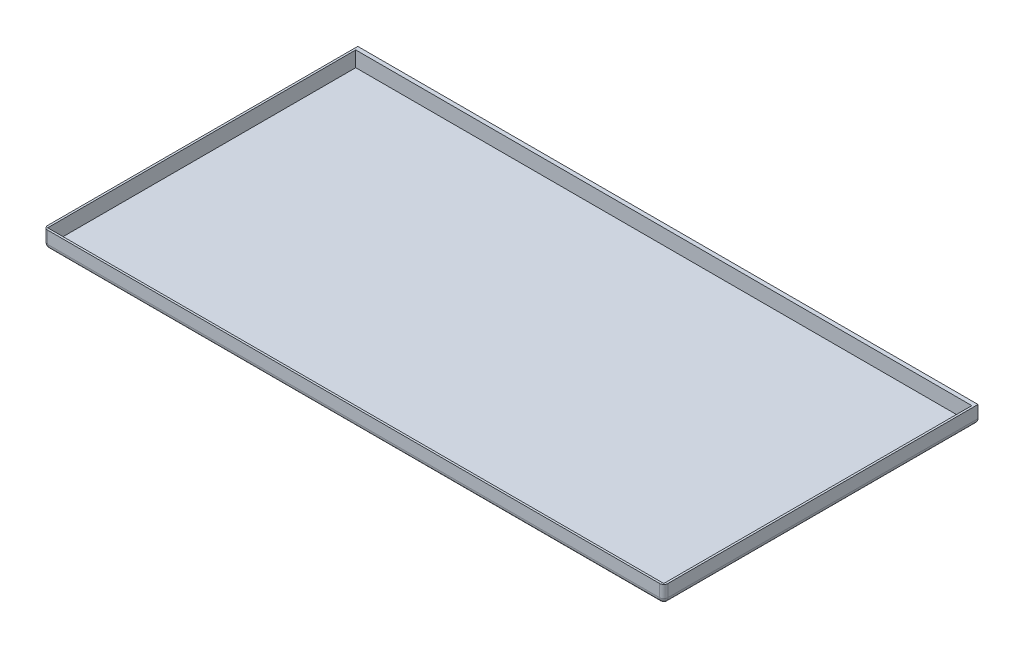
ISO-10303-21;
HEADER;
FILE_DESCRIPTION(('STEP AP214'),'2;1');
FILE_NAME('part.step','',(''),(''),'','','');
FILE_SCHEMA(('AUTOMOTIVE_DESIGN { 1 0 10303 214 1 1 1 1 }'));
ENDSEC;
DATA;
#1=APPLICATION_CONTEXT('core data for automotive mechanical design processes');
#2=APPLICATION_PROTOCOL_DEFINITION('international standard','automotive_design',2000,#1);
#3=PRODUCT_CONTEXT('',#1,'mechanical');
#4=PRODUCT('Part','Part','',(#3));
#5=PRODUCT_RELATED_PRODUCT_CATEGORY('part','',(#4));
#6=PRODUCT_DEFINITION_FORMATION('','',#4);
#7=PRODUCT_DEFINITION_CONTEXT('part definition',#1,'design');
#8=PRODUCT_DEFINITION('design','',#6,#7);
#9=PRODUCT_DEFINITION_SHAPE('','',#8);
#10=(LENGTH_UNIT() NAMED_UNIT(*) SI_UNIT(.MILLI.,.METRE.));
#11=(NAMED_UNIT(*) PLANE_ANGLE_UNIT() SI_UNIT($,.RADIAN.));
#12=(NAMED_UNIT(*) SI_UNIT($,.STERADIAN.) SOLID_ANGLE_UNIT());
#13=UNCERTAINTY_MEASURE_WITH_UNIT(LENGTH_MEASURE(1.E-05),#10,'distance_accuracy_value','');
#14=(GEOMETRIC_REPRESENTATION_CONTEXT(3) GLOBAL_UNCERTAINTY_ASSIGNED_CONTEXT((#13)) GLOBAL_UNIT_ASSIGNED_CONTEXT((#10,
#11,#12)) REPRESENTATION_CONTEXT('',''));
#15=CARTESIAN_POINT('',(0.,0.,0.));
#16=DIRECTION('',(0.,0.,1.));
#17=DIRECTION('',(1.,0.,0.));
#18=AXIS2_PLACEMENT_3D('',#15,#16,#17);
#19=CARTESIAN_POINT('',(-604.,4.,306.));
#20=DIRECTION('',(-1.,0.,0.));
#21=DIRECTION('',(0.,0.,1.));
#22=AXIS2_PLACEMENT_3D('',#19,#20,#21);
#23=PLANE('',#22);
#24=DIRECTION('',(0.,0.,-1.));
#25=VECTOR('',#24,1.);
#26=CARTESIAN_POINT('',(-604.,10.,306.));
#27=LINE('',#26,#25);
#28=CARTESIAN_POINT('',(-604.,10.,-306.));
#29=VERTEX_POINT('',#28);
#30=CARTESIAN_POINT('',(-604.,10.,298.));
#31=VERTEX_POINT('',#30);
#32=EDGE_CURVE('E235',#29,#31,#27,.F.);
#33=ORIENTED_EDGE('',*,*,#32,.T.);
#34=DIRECTION('',(0.,-1.,0.));
#35=VECTOR('',#34,1.);
#36=CARTESIAN_POINT('',(-604.,34.,298.));
#37=LINE('',#36,#35);
#38=CARTESIAN_POINT('',(-604.,34.,298.));
#39=VERTEX_POINT('',#38);
#40=EDGE_CURVE('E67',#31,#39,#37,.F.);
#41=ORIENTED_EDGE('',*,*,#40,.T.);
#42=DIRECTION('',(0.,0.,1.));
#43=VECTOR('',#42,1.);
#44=CARTESIAN_POINT('',(-604.,34.,306.));
#45=LINE('',#44,#43);
#46=CARTESIAN_POINT('',(-604.,34.,-306.));
#47=VERTEX_POINT('',#46);
#48=EDGE_CURVE('E197',#47,#39,#45,.T.);
#49=ORIENTED_EDGE('',*,*,#48,.F.);
#50=DIRECTION('',(0.,-1.,0.));
#51=VECTOR('',#50,1.);
#52=CARTESIAN_POINT('',(-604.,4.,-306.));
#53=LINE('',#52,#51);
#54=EDGE_CURVE('E203',#47,#29,#53,.T.);
#55=ORIENTED_EDGE('',*,*,#54,.T.);
#56=EDGE_LOOP('',(#33,#41,#49,#55));
#57=FACE_BOUND('',#56,.T.);
#58=ADVANCED_FACE('F41',(#57),#23,.T.);
#59=CARTESIAN_POINT('',(-604.,4.,306.));
#60=DIRECTION('',(0.,0.,-1.));
#61=DIRECTION('',(-1.,0.,0.));
#62=AXIS2_PLACEMENT_3D('',#59,#60,#61);
#63=PLANE('',#62);
#64=DIRECTION('',(1.,0.,0.));
#65=VECTOR('',#64,1.);
#66=CARTESIAN_POINT('',(-604.,34.,306.));
#67=LINE('',#66,#65);
#68=CARTESIAN_POINT('',(-596.,34.,306.));
#69=VERTEX_POINT('',#68);
#70=CARTESIAN_POINT('',(596.,34.,306.));
#71=VERTEX_POINT('',#70);
#72=EDGE_CURVE('E200',#69,#71,#67,.T.);
#73=ORIENTED_EDGE('',*,*,#72,.F.);
#74=DIRECTION('',(0.,-1.,0.));
#75=VECTOR('',#74,1.);
#76=CARTESIAN_POINT('',(-596.,10.,306.));
#77=LINE('',#76,#75);
#78=CARTESIAN_POINT('',(-596.,10.,306.));
#79=VERTEX_POINT('',#78);
#80=EDGE_CURVE('E263',#69,#79,#77,.T.);
#81=ORIENTED_EDGE('',*,*,#80,.T.);
#82=DIRECTION('',(1.,0.,0.));
#83=VECTOR('',#82,1.);
#84=CARTESIAN_POINT('',(604.,10.,306.));
#85=LINE('',#84,#83);
#86=CARTESIAN_POINT('',(596.,10.,306.));
#87=VERTEX_POINT('',#86);
#88=EDGE_CURVE('E208',#79,#87,#85,.T.);
#89=ORIENTED_EDGE('',*,*,#88,.T.);
#90=DIRECTION('',(0.,-1.,0.));
#91=VECTOR('',#90,1.);
#92=CARTESIAN_POINT('',(596.,4.,306.));
#93=LINE('',#92,#91);
#94=EDGE_CURVE('E260',#87,#71,#93,.F.);
#95=ORIENTED_EDGE('',*,*,#94,.T.);
#96=EDGE_LOOP('',(#73,#81,#89,#95));
#97=FACE_BOUND('',#96,.T.);
#98=ADVANCED_FACE('F312',(#97),#63,.F.);
#99=CARTESIAN_POINT('',(604.,4.,306.));
#100=DIRECTION('',(-1.,0.,0.));
#101=DIRECTION('',(0.,0.,1.));
#102=AXIS2_PLACEMENT_3D('',#99,#100,#101);
#103=PLANE('',#102);
#104=DIRECTION('',(0.,0.,-1.));
#105=VECTOR('',#104,1.);
#106=CARTESIAN_POINT('',(604.,34.,306.));
#107=LINE('',#106,#105);
#108=CARTESIAN_POINT('',(604.,34.,298.));
#109=VERTEX_POINT('',#108);
#110=CARTESIAN_POINT('',(604.,34.,-306.));
#111=VERTEX_POINT('',#110);
#112=EDGE_CURVE('E156',#109,#111,#107,.T.);
#113=ORIENTED_EDGE('',*,*,#112,.F.);
#114=DIRECTION('',(0.,-1.,0.));
#115=VECTOR('',#114,1.);
#116=CARTESIAN_POINT('',(604.,4.,298.));
#117=LINE('',#116,#115);
#118=CARTESIAN_POINT('',(604.,10.,298.));
#119=VERTEX_POINT('',#118);
#120=EDGE_CURVE('E11',#109,#119,#117,.T.);
#121=ORIENTED_EDGE('',*,*,#120,.T.);
#122=DIRECTION('',(0.,0.,-1.));
#123=VECTOR('',#122,1.);
#124=CARTESIAN_POINT('',(604.,10.,-306.));
#125=LINE('',#124,#123);
#126=CARTESIAN_POINT('',(604.,10.,-306.));
#127=VERTEX_POINT('',#126);
#128=EDGE_CURVE('E229',#119,#127,#125,.T.);
#129=ORIENTED_EDGE('',*,*,#128,.T.);
#130=DIRECTION('',(0.,-1.,0.));
#131=VECTOR('',#130,1.);
#132=CARTESIAN_POINT('',(604.,4.,-306.));
#133=LINE('',#132,#131);
#134=EDGE_CURVE('E204',#111,#127,#133,.T.);
#135=ORIENTED_EDGE('',*,*,#134,.F.);
#136=EDGE_LOOP('',(#113,#121,#129,#135));
#137=FACE_BOUND('',#136,.T.);
#138=ADVANCED_FACE('F316',(#137),#103,.F.);
#139=CARTESIAN_POINT('',(-604.,4.,-306.));
#140=DIRECTION('',(0.,0.,-1.));
#141=DIRECTION('',(-1.,0.,0.));
#142=AXIS2_PLACEMENT_3D('',#139,#140,#141);
#143=PLANE('',#142);
#144=ORIENTED_EDGE('',*,*,#134,.T.);
#145=DIRECTION('',(1.,0.,0.));
#146=VECTOR('',#145,1.);
#147=CARTESIAN_POINT('',(-604.,10.,-306.));
#148=LINE('',#147,#146);
#149=EDGE_CURVE('E232',#127,#29,#148,.F.);
#150=ORIENTED_EDGE('',*,*,#149,.T.);
#151=ORIENTED_EDGE('',*,*,#54,.F.);
#152=DIRECTION('',(-1.,0.,0.));
#153=VECTOR('',#152,1.);
#154=CARTESIAN_POINT('',(-604.,34.,-306.));
#155=LINE('',#154,#153);
#156=EDGE_CURVE('E193',#111,#47,#155,.T.);
#157=ORIENTED_EDGE('',*,*,#156,.F.);
#158=EDGE_LOOP('',(#144,#150,#151,#157));
#159=FACE_BOUND('',#158,.T.);
#160=ADVANCED_FACE('F320',(#159),#143,.T.);
#161=CARTESIAN_POINT('',(0.,0.,0.));
#162=DIRECTION('',(0.,-1.,0.));
#163=DIRECTION('',(0.,0.,-1.));
#164=AXIS2_PLACEMENT_3D('',#161,#162,#163);
#165=PLANE('',#164);
#166=DIRECTION('',(0.,0.,-1.));
#167=VECTOR('',#166,1.);
#168=CARTESIAN_POINT('',(594.,0.,306.));
#169=LINE('',#168,#167);
#170=CARTESIAN_POINT('',(594.,0.,-296.));
#171=VERTEX_POINT('',#170);
#172=CARTESIAN_POINT('',(594.,0.,296.));
#173=VERTEX_POINT('',#172);
#174=EDGE_CURVE('E221',#171,#173,#169,.F.);
#175=ORIENTED_EDGE('',*,*,#174,.T.);
#176=DIRECTION('',(1.,0.,0.));
#177=VECTOR('',#176,1.);
#178=CARTESIAN_POINT('',(-604.,0.,296.));
#179=LINE('',#178,#177);
#180=CARTESIAN_POINT('',(-594.,0.,296.));
#181=VERTEX_POINT('',#180);
#182=EDGE_CURVE('E225',#173,#181,#179,.F.);
#183=ORIENTED_EDGE('',*,*,#182,.T.);
#184=DIRECTION('',(0.,0.,-1.));
#185=VECTOR('',#184,1.);
#186=CARTESIAN_POINT('',(-594.,0.,0.));
#187=LINE('',#186,#185);
#188=CARTESIAN_POINT('',(-594.,0.,-296.));
#189=VERTEX_POINT('',#188);
#190=EDGE_CURVE('E215',#181,#189,#187,.T.);
#191=ORIENTED_EDGE('',*,*,#190,.T.);
#192=DIRECTION('',(1.,0.,0.));
#193=VECTOR('',#192,1.);
#194=CARTESIAN_POINT('',(0.,0.,-296.));
#195=LINE('',#194,#193);
#196=EDGE_CURVE('E218',#189,#171,#195,.T.);
#197=ORIENTED_EDGE('',*,*,#196,.T.);
#198=EDGE_LOOP('',(#175,#183,#191,#197));
#199=FACE_BOUND('',#198,.T.);
#200=ADVANCED_FACE('F323',(#199),#165,.T.);
#201=CARTESIAN_POINT('',(0.,34.,0.));
#202=DIRECTION('',(0.,-1.,0.));
#203=DIRECTION('',(0.,0.,-1.));
#204=AXIS2_PLACEMENT_3D('',#201,#202,#203);
#205=PLANE('',#204);
#206=ORIENTED_EDGE('',*,*,#48,.T.);
#207=CARTESIAN_POINT('',(-596.,34.,298.));
#208=DIRECTION('',(0.,-1.,0.));
#209=DIRECTION('',(0.,0.,-1.));
#210=AXIS2_PLACEMENT_3D('',#207,#208,#209);
#211=CIRCLE('',#210,8.);
#212=EDGE_CURVE('E51',#39,#69,#211,.F.);
#213=ORIENTED_EDGE('',*,*,#212,.T.);
#214=ORIENTED_EDGE('',*,*,#72,.T.);
#215=CARTESIAN_POINT('',(596.,34.,298.));
#216=DIRECTION('',(0.,-1.,0.));
#217=DIRECTION('',(0.,0.,-1.));
#218=AXIS2_PLACEMENT_3D('',#215,#216,#217);
#219=CIRCLE('',#218,8.);
#220=EDGE_CURVE('E59',#71,#109,#219,.F.);
#221=ORIENTED_EDGE('',*,*,#220,.T.);
#222=ORIENTED_EDGE('',*,*,#112,.T.);
#223=ORIENTED_EDGE('',*,*,#156,.T.);
#224=EDGE_LOOP('',(#206,#213,#214,#221,#222,#223));
#225=FACE_BOUND('',#224,.T.);
#226=DIRECTION('',(0.,0.,-1.));
#227=VECTOR('',#226,1.);
#228=CARTESIAN_POINT('',(600.,34.,-298.));
#229=LINE('',#228,#227);
#230=CARTESIAN_POINT('',(600.,34.,302.));
#231=VERTEX_POINT('',#230);
#232=CARTESIAN_POINT('',(600.,34.,-298.));
#233=VERTEX_POINT('',#232);
#234=EDGE_CURVE('E136',#231,#233,#229,.T.);
#235=ORIENTED_EDGE('',*,*,#234,.F.);
#236=DIRECTION('',(1.,0.,0.));
#237=VECTOR('',#236,1.);
#238=CARTESIAN_POINT('',(-600.,34.,302.));
#239=LINE('',#238,#237);
#240=CARTESIAN_POINT('',(-600.,34.,302.));
#241=VERTEX_POINT('',#240);
#242=EDGE_CURVE('E166',#241,#231,#239,.T.);
#243=ORIENTED_EDGE('',*,*,#242,.F.);
#244=DIRECTION('',(0.,0.,1.));
#245=VECTOR('',#244,1.);
#246=CARTESIAN_POINT('',(-600.,34.,-298.));
#247=LINE('',#246,#245);
#248=CARTESIAN_POINT('',(-600.,34.,-298.));
#249=VERTEX_POINT('',#248);
#250=EDGE_CURVE('E162',#249,#241,#247,.T.);
#251=ORIENTED_EDGE('',*,*,#250,.F.);
#252=DIRECTION('',(-1.,0.,0.));
#253=VECTOR('',#252,1.);
#254=CARTESIAN_POINT('',(-600.,34.,-298.));
#255=LINE('',#254,#253);
#256=EDGE_CURVE('E147',#233,#249,#255,.T.);
#257=ORIENTED_EDGE('',*,*,#256,.F.);
#258=EDGE_LOOP('',(#235,#243,#251,#257));
#259=FACE_BOUND('',#258,.T.);
#260=ADVANCED_FACE('F160',(#225,#259),#205,.F.);
#261=CARTESIAN_POINT('',(600.,34.,-298.));
#262=DIRECTION('',(-1.,0.,0.));
#263=DIRECTION('',(0.,0.,1.));
#264=AXIS2_PLACEMENT_3D('',#261,#262,#263);
#265=PLANE('',#264);
#266=DIRECTION('',(0.,0.,-1.));
#267=VECTOR('',#266,1.);
#268=CARTESIAN_POINT('',(600.,4.,-298.));
#269=LINE('',#268,#267);
#270=CARTESIAN_POINT('',(600.,4.,302.));
#271=VERTEX_POINT('',#270);
#272=CARTESIAN_POINT('',(600.,4.,-298.));
#273=VERTEX_POINT('',#272);
#274=EDGE_CURVE('E171',#271,#273,#269,.T.);
#275=ORIENTED_EDGE('',*,*,#274,.F.);
#276=DIRECTION('',(0.,-1.,0.));
#277=VECTOR('',#276,1.);
#278=CARTESIAN_POINT('',(600.,34.,302.));
#279=LINE('',#278,#277);
#280=EDGE_CURVE('E142',#231,#271,#279,.T.);
#281=ORIENTED_EDGE('',*,*,#280,.F.);
#282=ORIENTED_EDGE('',*,*,#234,.T.);
#283=DIRECTION('',(0.,-1.,0.));
#284=VECTOR('',#283,1.);
#285=CARTESIAN_POINT('',(600.,34.,-298.));
#286=LINE('',#285,#284);
#287=EDGE_CURVE('E140',#233,#273,#286,.T.);
#288=ORIENTED_EDGE('',*,*,#287,.T.);
#289=EDGE_LOOP('',(#275,#281,#282,#288));
#290=FACE_BOUND('',#289,.T.);
#291=ADVANCED_FACE('F139',(#290),#265,.T.);
#292=CARTESIAN_POINT('',(-600.,34.,-298.));
#293=DIRECTION('',(0.,0.,1.));
#294=DIRECTION('',(1.,0.,0.));
#295=AXIS2_PLACEMENT_3D('',#292,#293,#294);
#296=PLANE('',#295);
#297=DIRECTION('',(-1.,0.,0.));
#298=VECTOR('',#297,1.);
#299=CARTESIAN_POINT('',(-600.,4.,-298.));
#300=LINE('',#299,#298);
#301=CARTESIAN_POINT('',(-600.,4.,-298.));
#302=VERTEX_POINT('',#301);
#303=EDGE_CURVE('E154',#273,#302,#300,.T.);
#304=ORIENTED_EDGE('',*,*,#303,.F.);
#305=ORIENTED_EDGE('',*,*,#287,.F.);
#306=ORIENTED_EDGE('',*,*,#256,.T.);
#307=DIRECTION('',(0.,-1.,0.));
#308=VECTOR('',#307,1.);
#309=CARTESIAN_POINT('',(-600.,34.,-298.));
#310=LINE('',#309,#308);
#311=EDGE_CURVE('E157',#249,#302,#310,.T.);
#312=ORIENTED_EDGE('',*,*,#311,.T.);
#313=EDGE_LOOP('',(#304,#305,#306,#312));
#314=FACE_BOUND('',#313,.T.);
#315=ADVANCED_FACE('F151',(#314),#296,.T.);
#316=CARTESIAN_POINT('',(-600.,34.,-298.));
#317=DIRECTION('',(1.,0.,0.));
#318=DIRECTION('',(0.,0.,-1.));
#319=AXIS2_PLACEMENT_3D('',#316,#317,#318);
#320=PLANE('',#319);
#321=DIRECTION('',(0.,0.,1.));
#322=VECTOR('',#321,1.);
#323=CARTESIAN_POINT('',(-600.,4.,-298.));
#324=LINE('',#323,#322);
#325=CARTESIAN_POINT('',(-600.,4.,302.));
#326=VERTEX_POINT('',#325);
#327=EDGE_CURVE('E177',#302,#326,#324,.T.);
#328=ORIENTED_EDGE('',*,*,#327,.F.);
#329=ORIENTED_EDGE('',*,*,#311,.F.);
#330=ORIENTED_EDGE('',*,*,#250,.T.);
#331=DIRECTION('',(0.,-1.,0.));
#332=VECTOR('',#331,1.);
#333=CARTESIAN_POINT('',(-600.,34.,302.));
#334=LINE('',#333,#332);
#335=EDGE_CURVE('E186',#241,#326,#334,.T.);
#336=ORIENTED_EDGE('',*,*,#335,.T.);
#337=EDGE_LOOP('',(#328,#329,#330,#336));
#338=FACE_BOUND('',#337,.T.);
#339=ADVANCED_FACE('F342',(#338),#320,.T.);
#340=CARTESIAN_POINT('',(-600.,34.,302.));
#341=DIRECTION('',(0.,0.,-1.));
#342=DIRECTION('',(-1.,0.,0.));
#343=AXIS2_PLACEMENT_3D('',#340,#341,#342);
#344=PLANE('',#343);
#345=DIRECTION('',(1.,0.,0.));
#346=VECTOR('',#345,1.);
#347=CARTESIAN_POINT('',(-600.,4.,302.));
#348=LINE('',#347,#346);
#349=EDGE_CURVE('E148',#326,#271,#348,.T.);
#350=ORIENTED_EDGE('',*,*,#349,.F.);
#351=ORIENTED_EDGE('',*,*,#335,.F.);
#352=ORIENTED_EDGE('',*,*,#242,.T.);
#353=ORIENTED_EDGE('',*,*,#280,.T.);
#354=EDGE_LOOP('',(#350,#351,#352,#353));
#355=FACE_BOUND('',#354,.T.);
#356=ADVANCED_FACE('F334',(#355),#344,.T.);
#357=CARTESIAN_POINT('',(0.,4.,0.));
#358=DIRECTION('',(0.,-1.,0.));
#359=DIRECTION('',(0.,0.,-1.));
#360=AXIS2_PLACEMENT_3D('',#357,#358,#359);
#361=PLANE('',#360);
#362=ORIENTED_EDGE('',*,*,#349,.T.);
#363=ORIENTED_EDGE('',*,*,#274,.T.);
#364=ORIENTED_EDGE('',*,*,#303,.T.);
#365=ORIENTED_EDGE('',*,*,#327,.T.);
#366=EDGE_LOOP('',(#362,#363,#364,#365));
#367=FACE_BOUND('',#366,.T.);
#368=ADVANCED_FACE('F331',(#367),#361,.F.);
#369=CARTESIAN_POINT('',(0.,10.,-296.));
#370=DIRECTION('',(1.,0.,0.));
#371=DIRECTION('',(0.,0.,-1.));
#372=AXIS2_PLACEMENT_3D('',#369,#370,#371);
#373=CYLINDRICAL_SURFACE('',#372,10.);
#374=CARTESIAN_POINT('',(594.,10.,-296.));
#375=DIRECTION('',(0.707106781186547,0.,0.707106781186547));
#376=DIRECTION('',(0.707106781186547,0.,-0.707106781186547));
#377=AXIS2_PLACEMENT_3D('',#374,#375,#376);
#378=ELLIPSE('',#377,14.1421356237309,10.);
#379=EDGE_CURVE('E239',#171,#127,#378,.T.);
#380=ORIENTED_EDGE('',*,*,#379,.F.);
#381=ORIENTED_EDGE('',*,*,#196,.F.);
#382=CARTESIAN_POINT('',(-594.,10.,-296.));
#383=DIRECTION('',(0.707106781186547,0.,-0.707106781186547));
#384=DIRECTION('',(-0.707106781186547,0.,-0.707106781186547));
#385=AXIS2_PLACEMENT_3D('',#382,#383,#384);
#386=ELLIPSE('',#385,14.1421356237309,10.);
#387=EDGE_CURVE('E174',#29,#189,#386,.F.);
#388=ORIENTED_EDGE('',*,*,#387,.F.);
#389=ORIENTED_EDGE('',*,*,#149,.F.);
#390=EDGE_LOOP('',(#380,#381,#388,#389));
#391=FACE_BOUND('',#390,.T.);
#392=ADVANCED_FACE('F288',(#391),#373,.T.);
#393=CARTESIAN_POINT('',(-594.,10.,0.));
#394=DIRECTION('',(0.,0.,-1.));
#395=DIRECTION('',(-1.,0.,0.));
#396=AXIS2_PLACEMENT_3D('',#393,#394,#395);
#397=CYLINDRICAL_SURFACE('',#396,10.);
#398=ORIENTED_EDGE('',*,*,#190,.F.);
#399=CARTESIAN_POINT('',(-594.,10.,296.));
#400=DIRECTION('',(0.196116135138184,0.,0.98058067569092));
#401=DIRECTION('',(-0.98058067569092,0.,0.196116135138184));
#402=AXIS2_PLACEMENT_3D('',#399,#400,#401);
#403=ELLIPSE('',#402,10.1980390271856,10.);
#404=EDGE_CURVE('E254',#181,#31,#403,.F.);
#405=ORIENTED_EDGE('',*,*,#404,.T.);
#406=ORIENTED_EDGE('',*,*,#32,.F.);
#407=ORIENTED_EDGE('',*,*,#387,.T.);
#408=EDGE_LOOP('',(#398,#405,#406,#407));
#409=FACE_BOUND('',#408,.T.);
#410=ADVANCED_FACE('F293',(#409),#397,.T.);
#411=CARTESIAN_POINT('',(594.,10.,306.));
#412=DIRECTION('',(0.,0.,1.));
#413=DIRECTION('',(1.,0.,0.));
#414=AXIS2_PLACEMENT_3D('',#411,#412,#413);
#415=CYLINDRICAL_SURFACE('',#414,10.);
#416=ORIENTED_EDGE('',*,*,#128,.F.);
#417=CARTESIAN_POINT('',(594.,10.,296.));
#418=DIRECTION('',(0.196116135138184,0.,-0.98058067569092));
#419=DIRECTION('',(-0.98058067569092,0.,-0.196116135138184));
#420=AXIS2_PLACEMENT_3D('',#417,#418,#419);
#421=ELLIPSE('',#420,10.1980390271856,10.);
#422=EDGE_CURVE('E257',#119,#173,#421,.T.);
#423=ORIENTED_EDGE('',*,*,#422,.T.);
#424=ORIENTED_EDGE('',*,*,#174,.F.);
#425=ORIENTED_EDGE('',*,*,#379,.T.);
#426=EDGE_LOOP('',(#416,#423,#424,#425));
#427=FACE_BOUND('',#426,.T.);
#428=ADVANCED_FACE('F296',(#427),#415,.T.);
#429=CARTESIAN_POINT('',(-604.,10.,296.));
#430=DIRECTION('',(-1.,0.,0.));
#431=DIRECTION('',(0.,0.,1.));
#432=AXIS2_PLACEMENT_3D('',#429,#430,#431);
#433=CYLINDRICAL_SURFACE('',#432,10.);
#434=ORIENTED_EDGE('',*,*,#88,.F.);
#435=CARTESIAN_POINT('',(-594.,10.,296.));
#436=DIRECTION('',(0.98058067569092,0.,0.196116135138184));
#437=DIRECTION('',(-0.196116135138184,0.,0.98058067569092));
#438=AXIS2_PLACEMENT_3D('',#435,#436,#437);
#439=ELLIPSE('',#438,10.1980390271856,10.);
#440=EDGE_CURVE('E250',#79,#181,#439,.T.);
#441=ORIENTED_EDGE('',*,*,#440,.T.);
#442=ORIENTED_EDGE('',*,*,#182,.F.);
#443=CARTESIAN_POINT('',(594.,10.,296.));
#444=DIRECTION('',(0.98058067569092,0.,-0.196116135138184));
#445=DIRECTION('',(-0.196116135138184,0.,-0.98058067569092));
#446=AXIS2_PLACEMENT_3D('',#443,#444,#445);
#447=ELLIPSE('',#446,10.1980390271856,10.);
#448=EDGE_CURVE('E238',#173,#87,#447,.F.);
#449=ORIENTED_EDGE('',*,*,#448,.T.);
#450=EDGE_LOOP('',(#434,#441,#442,#449));
#451=FACE_BOUND('',#450,.T.);
#452=ADVANCED_FACE('F289',(#451),#433,.T.);
#453=CARTESIAN_POINT('',(-596.,4.,298.));
#454=DIRECTION('',(0.,1.,0.));
#455=DIRECTION('',(0.,0.,1.));
#456=AXIS2_PLACEMENT_3D('',#453,#454,#455);
#457=CYLINDRICAL_SURFACE('',#456,8.);
#458=ORIENTED_EDGE('',*,*,#212,.F.);
#459=ORIENTED_EDGE('',*,*,#40,.F.);
#460=CARTESIAN_POINT('',(-596.,10.,298.));
#461=DIRECTION('',(0.,-1.,0.));
#462=DIRECTION('',(0.,0.,-1.));
#463=AXIS2_PLACEMENT_3D('',#460,#461,#462);
#464=CIRCLE('',#463,8.);
#465=EDGE_CURVE('E243',#79,#31,#464,.T.);
#466=ORIENTED_EDGE('',*,*,#465,.F.);
#467=ORIENTED_EDGE('',*,*,#80,.F.);
#468=EDGE_LOOP('',(#458,#459,#466,#467));
#469=FACE_BOUND('',#468,.T.);
#470=ADVANCED_FACE('F286',(#469),#457,.T.);
#471=CARTESIAN_POINT('',(-594.,0.,296.));
#472=CARTESIAN_POINT('',(-594.,0.,296.));
#473=CARTESIAN_POINT('',(-594.,0.,296.));
#474=CARTESIAN_POINT('',(-594.043573473437,1.25514960019557E-05,296.217867367188));
#475=CARTESIAN_POINT('',(-594.130720948449,1.65259054189096E-05,296.130720948449));
#476=CARTESIAN_POINT('',(-594.217867367187,1.25514959548304E-05,296.043573473438));
#477=CARTESIAN_POINT('',(-594.087140661635,0.00711973318523013,296.435703308175));
#478=CARTESIAN_POINT('',(-594.261514919361,0.00142219092468911,296.261514919361));
#479=CARTESIAN_POINT('',(-594.435703308174,0.00711973318518112,296.087140661635));
#480=CARTESIAN_POINT('',(-594.174185125265,0.0356078871057054,296.870925626324));
#481=CARTESIAN_POINT('',(-594.52376701987,0.0071640139354577,296.52376701987));
#482=CARTESIAN_POINT('',(-594.870925626323,0.0356078871056781,296.174185125265));
#483=CARTESIAN_POINT('',(-594.217662392893,0.0569900500550095,297.088311964466));
#484=CARTESIAN_POINT('',(-594.655413131939,0.0115086932098556,296.655413131939));
#485=CARTESIAN_POINT('',(-595.088311964465,0.0569900500550058,296.217662392893));
#486=CARTESIAN_POINT('',(-594.34706801719,0.142170927276629,297.735340085951));
#487=CARTESIAN_POINT('',(-595.050892919418,0.0291453319655504,297.050892919418));
#488=CARTESIAN_POINT('',(-595.735340085951,0.142170927276637,296.34706801719));
#489=CARTESIAN_POINT('',(-594.432740668291,0.227003521005286,298.163703341455));
#490=CARTESIAN_POINT('',(-595.317581310987,0.0470937552914061,297.317581310987));
#491=CARTESIAN_POINT('',(-596.163703341454,0.227003521005223,296.432740668291));
#492=CARTESIAN_POINT('',(-594.601111531531,0.452572227298851,299.005557657655));
#493=CARTESIAN_POINT('',(-595.858474534046,0.0986676813365502,297.858474534046));
#494=CARTESIAN_POINT('',(-597.005557657655,0.452572227298773,296.601111531531));
#495=CARTESIAN_POINT('',(-594.683835531341,0.592346806567144,299.419177656706));
#496=CARTESIAN_POINT('',(-596.134142146115,0.132348583386096,298.134142146115));
#497=CARTESIAN_POINT('',(-597.419177656706,0.592346806567121,296.683835531341));
#498=CARTESIAN_POINT('',(-594.84488972314,0.925902831971702,300.2244486157));
#499=CARTESIAN_POINT('',(-596.697597823972,0.221778366540025,298.697597823972));
#500=CARTESIAN_POINT('',(-598.2244486157,0.925902831971724,296.84488972314));
#501=CARTESIAN_POINT('',(-594.923277952584,1.11826902900491,300.616389762918));
#502=CARTESIAN_POINT('',(-596.986796313664,0.277584706107854,298.986796313664));
#503=CARTESIAN_POINT('',(-598.616389762918,1.11826902900493,296.923277952584));
#504=CARTESIAN_POINT('',(-595.074279979632,1.55417327004767,301.371399898162));
#505=CARTESIAN_POINT('',(-597.581427775057,0.421644240815134,299.581427775057));
#506=CARTESIAN_POINT('',(-599.371399898161,1.55417327004765,297.074279979632));
#507=CARTESIAN_POINT('',(-595.146998158506,1.79588761442184,301.734990792528));
#508=CARTESIAN_POINT('',(-597.888168387634,0.509909809669482,299.888168387634));
#509=CARTESIAN_POINT('',(-599.734990792528,1.7958876144218,297.146998158506));
#510=CARTESIAN_POINT('',(-595.285368075211,2.32676532893794,302.426840376057));
#511=CARTESIAN_POINT('',(-598.520539554242,0.734549953172988,300.520539554242));
#512=CARTESIAN_POINT('',(-600.426840376057,2.32676532893798,297.285368075211));
#513=CARTESIAN_POINT('',(-595.351183322788,2.61377702639902,302.755916613939));
#514=CARTESIAN_POINT('',(-598.847292203551,0.870795739487608,300.847292203551));
#515=CARTESIAN_POINT('',(-600.755916613939,2.61377702639916,297.351183322788));
#516=CARTESIAN_POINT('',(-595.474558580143,3.23066107192436,303.372792900713));
#517=CARTESIAN_POINT('',(-599.518751921652,1.21335541785852,301.518751921652));
#518=CARTESIAN_POINT('',(-601.372792900713,3.23066107192449,297.474558580143));
#519=CARTESIAN_POINT('',(-595.532350829785,3.55818655623342,303.661754148925));
#520=CARTESIAN_POINT('',(-599.864274927106,1.41921658511856,301.864274927106));
#521=CARTESIAN_POINT('',(-601.661754148924,3.55818655623346,297.532350829785));
#522=CARTESIAN_POINT('',(-595.638619341764,4.25066430156311,304.19309670882));
#523=CARTESIAN_POINT('',(-600.56524563787,1.92873593761273,302.56524563787));
#524=CARTESIAN_POINT('',(-602.19309670882,4.25066430156307,297.638619341764));
#525=CARTESIAN_POINT('',(-595.687397580319,4.61327259316511,304.436987901596));
#526=CARTESIAN_POINT('',(-600.921054371199,2.23129625521202,302.921054371199));
#527=CARTESIAN_POINT('',(-602.436987901596,4.6132725931651,297.687397580319));
#528=CARTESIAN_POINT('',(-595.774731964092,5.36964792915865,304.873659820463));
#529=CARTESIAN_POINT('',(-601.622935196772,2.96324219270186,303.622935196772));
#530=CARTESIAN_POINT('',(-602.873659820463,5.36964792915866,297.774731964093));
#531=CARTESIAN_POINT('',(-595.813644418633,5.76133161790261,305.068222093165));
#532=CARTESIAN_POINT('',(-601.968787073817,3.39038455416869,303.968787073817));
#533=CARTESIAN_POINT('',(-603.068222093165,5.76133161790261,297.813644418633));
#534=CARTESIAN_POINT('',(-595.880530527202,6.56878473440416,305.40265263601));
#535=CARTESIAN_POINT('',(-602.616266060929,4.39067923042249,304.61626606093));
#536=CARTESIAN_POINT('',(-603.40265263601,6.56878473440416,297.880530527202));
#537=CARTESIAN_POINT('',(-595.908874548532,6.98299865226762,305.544372742659));
#538=CARTESIAN_POINT('',(-602.917102520347,4.95981525896496,304.917102520348));
#539=CARTESIAN_POINT('',(-603.544372742659,6.98299865226762,297.908874548532));
#540=CARTESIAN_POINT('',(-595.954138834972,7.82774476205592,305.770694174861));
#541=CARTESIAN_POINT('',(-603.428575626805,6.23628500006584,305.428575626805));
#542=CARTESIAN_POINT('',(-603.770694174861,7.82774476205592,297.954138834972));
#543=CARTESIAN_POINT('',(-595.971376560639,8.25741352255733,305.856882803197));
#544=CARTESIAN_POINT('',(-603.638141612971,6.93735475467292,305.638141612971));
#545=CARTESIAN_POINT('',(-603.856882803197,8.25741352255733,297.971376560639));
#546=CARTESIAN_POINT('',(-595.994213992966,9.1248876223201,305.971069964832));
#547=CARTESIAN_POINT('',(-603.924246902235,8.42963055369438,305.924246902235));
#548=CARTESIAN_POINT('',(-603.971069964832,9.1248876223201,297.994213992966));
#549=CARTESIAN_POINT('',(-596.,9.56244381116005,306.));
#550=CARTESIAN_POINT('',(-604.,9.21252403267234,306.));
#551=CARTESIAN_POINT('',(-604.,9.56244381116005,298.));
#552=CARTESIAN_POINT('',(-596.,10.4375561888399,306.));
#553=CARTESIAN_POINT('',(-604.,10.7874759673277,306.));
#554=CARTESIAN_POINT('',(-604.,10.4375561888399,298.));
#555=CARTESIAN_POINT('',(-595.994213992966,10.8751123776799,305.971069964832));
#556=CARTESIAN_POINT('',(-603.924246902235,11.5703694463056,305.924246902235));
#557=CARTESIAN_POINT('',(-603.971069964832,10.8751123776799,297.994213992966));
#558=CARTESIAN_POINT('',(-595.971376560639,11.7425864774427,305.856882803197));
#559=CARTESIAN_POINT('',(-603.638141612971,13.0626452453271,305.638141612971));
#560=CARTESIAN_POINT('',(-603.856882803197,11.7425864774427,297.971376560639));
#561=CARTESIAN_POINT('',(-595.954138834972,12.1722552379441,305.770694174861));
#562=CARTESIAN_POINT('',(-603.428575626805,13.7637149999341,305.428575626805));
#563=CARTESIAN_POINT('',(-603.770694174861,12.1722552379441,297.954138834972));
#564=CARTESIAN_POINT('',(-595.908874548532,13.0170013477324,305.544372742659));
#565=CARTESIAN_POINT('',(-602.917102520348,15.040184741035,304.917102520348));
#566=CARTESIAN_POINT('',(-603.544372742659,13.0170013477324,297.908874548532));
#567=CARTESIAN_POINT('',(-595.880530527202,13.4312152655958,305.40265263601));
#568=CARTESIAN_POINT('',(-602.616266060929,15.6093207695775,304.61626606093));
#569=CARTESIAN_POINT('',(-603.40265263601,13.4312152655958,297.880530527202));
#570=CARTESIAN_POINT('',(-595.813644418633,14.2386683820974,305.068222093165));
#571=CARTESIAN_POINT('',(-601.968787073817,16.6096154458313,303.968787073817));
#572=CARTESIAN_POINT('',(-603.068222093165,14.2386683820974,297.813644418633));
#573=CARTESIAN_POINT('',(-595.774731964092,14.6303520708413,304.873659820463));
#574=CARTESIAN_POINT('',(-601.622935196772,17.0367578072981,303.622935196772));
#575=CARTESIAN_POINT('',(-602.873659820463,14.6303520708413,297.774731964093));
#576=CARTESIAN_POINT('',(-595.687397580319,15.3867274068349,304.436987901596));
#577=CARTESIAN_POINT('',(-600.9210543712,17.768703744788,302.9210543712));
#578=CARTESIAN_POINT('',(-602.436987901596,15.3867274068349,297.687397580319));
#579=CARTESIAN_POINT('',(-595.638619341764,15.7493356984369,304.19309670882));
#580=CARTESIAN_POINT('',(-600.56524563787,18.0712640623873,302.56524563787));
#581=CARTESIAN_POINT('',(-602.19309670882,15.7493356984369,297.638619341764));
#582=CARTESIAN_POINT('',(-595.532350829785,16.4418134437666,303.661754148925));
#583=CARTESIAN_POINT('',(-599.864274927106,18.5807834148814,301.864274927106));
#584=CARTESIAN_POINT('',(-601.661754148924,16.4418134437665,297.532350829785));
#585=CARTESIAN_POINT('',(-595.474558580143,16.7693389280756,303.372792900713));
#586=CARTESIAN_POINT('',(-599.518751921652,18.7866445821415,301.518751921652));
#587=CARTESIAN_POINT('',(-601.372792900713,16.7693389280755,297.474558580143));
#588=CARTESIAN_POINT('',(-595.351183322788,17.386222973601,302.755916613939));
#589=CARTESIAN_POINT('',(-598.847292203551,19.1292042605124,300.847292203551));
#590=CARTESIAN_POINT('',(-600.755916613939,17.3862229736008,297.351183322788));
#591=CARTESIAN_POINT('',(-595.285368075211,17.6732346710621,302.426840376057));
#592=CARTESIAN_POINT('',(-598.520539554242,19.265450046827,300.520539554242));
#593=CARTESIAN_POINT('',(-600.426840376057,17.673234671062,297.285368075211));
#594=CARTESIAN_POINT('',(-595.146998158506,18.2041123855782,301.734990792528));
#595=CARTESIAN_POINT('',(-597.888168387634,19.4900901903305,299.888168387634));
#596=CARTESIAN_POINT('',(-599.734990792528,18.2041123855782,297.146998158506));
#597=CARTESIAN_POINT('',(-595.074279979632,18.4458267299523,301.371399898161));
#598=CARTESIAN_POINT('',(-597.581427775057,19.5783557591849,299.581427775057));
#599=CARTESIAN_POINT('',(-599.371399898161,18.4458267299523,297.074279979632));
#600=CARTESIAN_POINT('',(-594.923277952584,18.8817309709951,300.616389762918));
#601=CARTESIAN_POINT('',(-596.986796313664,19.7224152938921,298.986796313664));
#602=CARTESIAN_POINT('',(-598.616389762918,18.8817309709951,296.923277952584));
#603=CARTESIAN_POINT('',(-594.84488972314,19.0740971680283,300.2244486157));
#604=CARTESIAN_POINT('',(-596.697597823972,19.77822163346,298.697597823972));
#605=CARTESIAN_POINT('',(-598.2244486157,19.0740971680283,296.84488972314));
#606=CARTESIAN_POINT('',(-594.683835531341,19.4076531934329,299.419177656706));
#607=CARTESIAN_POINT('',(-596.134142146115,19.8676514166139,298.134142146115));
#608=CARTESIAN_POINT('',(-597.419177656706,19.4076531934329,296.683835531341));
#609=CARTESIAN_POINT('',(-594.601111531531,19.5474277727012,299.005557657655));
#610=CARTESIAN_POINT('',(-595.858474534046,19.9013323186634,297.858474534046));
#611=CARTESIAN_POINT('',(-597.005557657655,19.5474277727012,296.601111531531));
#612=CARTESIAN_POINT('',(-594.432740668291,19.7729964789947,298.163703341455));
#613=CARTESIAN_POINT('',(-595.317581310987,19.9529062447086,297.317581310987));
#614=CARTESIAN_POINT('',(-596.163703341454,19.7729964789948,296.432740668291));
#615=CARTESIAN_POINT('',(-594.34706801719,19.8578290727233,297.735340085952));
#616=CARTESIAN_POINT('',(-595.050892919417,19.9708546680345,297.050892919418));
#617=CARTESIAN_POINT('',(-595.735340085951,19.8578290727234,296.34706801719));
#618=CARTESIAN_POINT('',(-594.217662392893,19.943009949945,297.088311964466));
#619=CARTESIAN_POINT('',(-594.655413131939,19.9884913067901,296.655413131939));
#620=CARTESIAN_POINT('',(-595.088311964465,19.943009949945,296.217662392893));
#621=CARTESIAN_POINT('',(-594.174185125265,19.9643921128943,296.870925626323));
#622=CARTESIAN_POINT('',(-594.52376701987,19.9928359860646,296.52376701987));
#623=CARTESIAN_POINT('',(-594.870925626323,19.9643921128943,296.174185125265));
#624=CARTESIAN_POINT('',(-594.087140661635,19.9928802668148,296.435703308174));
#625=CARTESIAN_POINT('',(-594.261514919361,19.9985778090753,296.261514919361));
#626=CARTESIAN_POINT('',(-594.435703308174,19.9928802668148,296.087140661635));
#627=CARTESIAN_POINT('',(-594.043573473438,19.999987448504,296.217867367187));
#628=CARTESIAN_POINT('',(-594.130720948449,19.9999834740946,296.130720948449));
#629=CARTESIAN_POINT('',(-594.217867367187,19.999987448504,296.043573473438));
#630=CARTESIAN_POINT('',(-594.,20.,296.));
#631=CARTESIAN_POINT('',(-594.,20.,296.));
#632=CARTESIAN_POINT('',(-594.,20.,296.));
#633=(BOUNDED_SURFACE() B_SPLINE_SURFACE(3,2,((#471,#472,#473),(#474,#475,#476),(#477,#478,
#479),(#480,#481,#482),(#483,#484,#485),(#486,#487,#488),(#489,#490,#491),(#492,#493,#494),
(#495,#496,#497),(#498,#499,#500),(#501,#502,#503),(#504,#505,#506),(#507,#508,#509),(#510,#511,
#512),(#513,#514,#515),(#516,#517,#518),(#519,#520,#521),(#522,#523,#524),(#525,#526,#527),
(#528,#529,#530),(#531,#532,#533),(#534,#535,#536),(#537,#538,#539),(#540,#541,#542),(#543,#544,
#545),(#546,#547,#548),(#549,#550,#551),(#552,#553,#554),(#555,#556,#557),(#558,#559,#560),
(#561,#562,#563),(#564,#565,#566),(#567,#568,#569),(#570,#571,#572),(#573,#574,#575),(#576,#577,
#578),(#579,#580,#581),(#582,#583,#584),(#585,#586,#587),(#588,#589,#590),(#591,#592,#593),
(#594,#595,#596),(#597,#598,#599),(#600,#601,#602),(#603,#604,#605),(#606,#607,#608),(#609,#610,
#611),(#612,#613,#614),(#615,#616,#617),(#618,#619,#620),(#621,#622,#623),(#624,#625,#626),
(#627,#628,#629),(#630,#631,#632)),.UNSPECIFIED.,.F.,.F.,.F.) B_SPLINE_SURFACE_WITH_KNOTS((4,2,
2,2,2,2,2,2,2,2,2,2,2,2,2,2,2,2,2,2,2,2,2,2,2,2,4),(3,3),(0.,0.184832059344272,0.36967953799935,
0.736118255130087,1.09641071236066,1.44782758329329,1.78805883225436,2.11536349489979,
2.4287242851067,2.72800011817539,3.01405869583471,3.28885438774293,3.55539893114261,
3.81757038381656,4.07974183649051,4.34628637989019,4.6210820717984,4.90714064945772,
5.20641648252642,5.51977727273332,5.84708193537876,6.18731318433983,6.53873005527245,
6.89902251250302,7.26546122963372,7.45030870828892,7.63514076763311),(0.,1.),
.UNSPECIFIED.) GEOMETRIC_REPRESENTATION_ITEM() RATIONAL_B_SPLINE_SURFACE(((1.,1.,1.),(1.,
0.999999961263619,1.),(1.,0.999643922941491,1.),(1.,0.998220838286359,1.),(1.,0.997153732641158,
1.),(1.,0.992912442662747,1.),(1.,0.98869813846485,1.),(1.,0.977616679304325,1.),(1.,
0.970795206105287,1.),(1.,0.954789240884277,1.),(1.,0.945667100032637,1.),(1.,0.925487939163272,
1.),(1.,0.914501748600801,1.),(1.,0.891170005673145,1.),(1.,0.878891958919871,1.),(1.,
0.853706991171878,1.),(1.,0.840849145478559,1.),(1.,0.815387454891637,1.),(1.,0.802798170214695,
1.),(1.,0.778880732145954,1.),(1.,0.767521437015676,1.),(1.,0.747118527019467,1.),(1.,
0.738001346920117,1.),(1.,0.723039691285844,1.),(1.,0.717105167895112,1.),(1.,0.709170186453634,
1.),(1.,0.707106781186548,1.),(1.,0.707106781186548,1.),(1.,0.709170186453634,1.),(1.,
0.717105167895111,1.),(1.,0.723039691285844,1.),(1.,0.738001346920117,1.),(1.,0.747118527019467,
1.),(1.,0.767521437015676,1.),(1.,0.778880732145954,1.),(1.,0.802798170214694,1.),(1.,
0.815387454891637,1.),(1.,0.840849145478559,1.),(1.,0.853706991171878,1.),(1.,0.878891958919871,
1.),(1.,0.891170005673145,1.),(1.,0.914501748600801,1.),(1.,0.925487939163272,1.),(1.,
0.945667100032637,1.),(1.,0.954789240884277,1.),(1.,0.970795206105287,1.),(1.,0.977616679304325,
1.),(1.,0.988698138464849,1.),(1.,0.992912442662747,1.),(1.,0.997153732641158,1.),(1.,
0.998220838286359,1.),(1.,0.999643922941491,1.),(1.,0.999999961263619,1.),(1.,1.,1.))) REPRESENTATION_ITEM('') SURFACE());
#634=ORIENTED_EDGE('',*,*,#465,.T.);
#635=ORIENTED_EDGE('',*,*,#404,.F.);
#636=ORIENTED_EDGE('',*,*,#440,.F.);
#637=EDGE_LOOP('',(#634,#635,#636));
#638=FACE_BOUND('',#637,.T.);
#639=ADVANCED_FACE('F278',(#638),#633,.T.);
#640=CARTESIAN_POINT('',(596.,4.,298.));
#641=DIRECTION('',(0.,-1.,0.));
#642=DIRECTION('',(0.,0.,-1.));
#643=AXIS2_PLACEMENT_3D('',#640,#641,#642);
#644=CYLINDRICAL_SURFACE('',#643,8.);
#645=ORIENTED_EDGE('',*,*,#220,.F.);
#646=ORIENTED_EDGE('',*,*,#94,.F.);
#647=CARTESIAN_POINT('',(596.,10.,298.));
#648=DIRECTION('',(0.,-1.,0.));
#649=DIRECTION('',(0.,0.,-1.));
#650=AXIS2_PLACEMENT_3D('',#647,#648,#649);
#651=CIRCLE('',#650,8.);
#652=EDGE_CURVE('E275',#119,#87,#651,.T.);
#653=ORIENTED_EDGE('',*,*,#652,.F.);
#654=ORIENTED_EDGE('',*,*,#120,.F.);
#655=EDGE_LOOP('',(#645,#646,#653,#654));
#656=FACE_BOUND('',#655,.T.);
#657=ADVANCED_FACE('F43',(#656),#644,.T.);
#658=CARTESIAN_POINT('',(594.,0.,296.));
#659=CARTESIAN_POINT('',(594.,0.,296.));
#660=CARTESIAN_POINT('',(594.,0.,296.));
#661=CARTESIAN_POINT('',(594.217867367187,1.25514959674501E-05,296.043573473438));
#662=CARTESIAN_POINT('',(594.130720948449,1.65259054249808E-05,296.130720948449));
#663=CARTESIAN_POINT('',(594.043573473437,1.25514959945542E-05,296.217867367187));
#664=CARTESIAN_POINT('',(594.435703308174,0.0071197331851791,296.087140661635));
#665=CARTESIAN_POINT('',(594.26151491936,0.00142219092469264,296.261514919361));
#666=CARTESIAN_POINT('',(594.087140661635,0.0071197331852139,296.435703308174));
#667=CARTESIAN_POINT('',(594.870925626323,0.0356078871056414,296.174185125265));
#668=CARTESIAN_POINT('',(594.52376701987,0.00716401393545271,296.52376701987));
#669=CARTESIAN_POINT('',(594.174185125265,0.0356078871056795,296.870925626323));
#670=CARTESIAN_POINT('',(595.088311964465,0.0569900500549763,296.217662392893));
#671=CARTESIAN_POINT('',(594.655413131939,0.0115086932098502,296.655413131939));
#672=CARTESIAN_POINT('',(594.217662392893,0.0569900500550099,297.088311964466));
#673=CARTESIAN_POINT('',(595.735340085951,0.142170927276629,296.34706801719));
#674=CARTESIAN_POINT('',(595.050892919418,0.0291453319655474,297.050892919418));
#675=CARTESIAN_POINT('',(594.34706801719,0.142170927276671,297.735340085952));
#676=CARTESIAN_POINT('',(596.163703341454,0.227003521005228,296.432740668291));
#677=CARTESIAN_POINT('',(595.317581310987,0.0470937552914086,297.317581310987));
#678=CARTESIAN_POINT('',(594.432740668291,0.227003521005305,298.163703341455));
#679=CARTESIAN_POINT('',(597.005557657655,0.452572227298781,296.601111531531));
#680=CARTESIAN_POINT('',(595.858474534046,0.0986676813365539,297.858474534046));
#681=CARTESIAN_POINT('',(594.601111531531,0.452572227298845,299.005557657655));
#682=CARTESIAN_POINT('',(597.419177656706,0.592346806567123,296.683835531341));
#683=CARTESIAN_POINT('',(596.134142146115,0.132348583386097,298.134142146115));
#684=CARTESIAN_POINT('',(594.683835531341,0.592346806567143,299.419177656706));
#685=CARTESIAN_POINT('',(598.2244486157,0.925902831971722,296.84488972314));
#686=CARTESIAN_POINT('',(596.697597823972,0.221778366540024,298.697597823972));
#687=CARTESIAN_POINT('',(594.84488972314,0.925902831971703,300.2244486157));
#688=CARTESIAN_POINT('',(598.616389762918,1.11826902900493,296.923277952584));
#689=CARTESIAN_POINT('',(596.986796313664,0.277584706107854,298.986796313664));
#690=CARTESIAN_POINT('',(594.923277952584,1.11826902900491,300.616389762918));
#691=CARTESIAN_POINT('',(599.371399898161,1.55417327004765,297.074279979632));
#692=CARTESIAN_POINT('',(597.581427775057,0.421644240815134,299.581427775057));
#693=CARTESIAN_POINT('',(595.074279979632,1.55417327004767,301.371399898162));
#694=CARTESIAN_POINT('',(599.734990792528,1.7958876144218,297.146998158506));
#695=CARTESIAN_POINT('',(597.888168387634,0.509909809669482,299.888168387634));
#696=CARTESIAN_POINT('',(595.146998158506,1.79588761442184,301.734990792528));
#697=CARTESIAN_POINT('',(600.426840376057,2.32676532893798,297.285368075211));
#698=CARTESIAN_POINT('',(598.520539554242,0.734549953172988,300.520539554242));
#699=CARTESIAN_POINT('',(595.285368075211,2.32676532893794,302.426840376057));
#700=CARTESIAN_POINT('',(600.755916613939,2.61377702639916,297.351183322788));
#701=CARTESIAN_POINT('',(598.847292203551,0.870795739487608,300.847292203551));
#702=CARTESIAN_POINT('',(595.351183322788,2.61377702639902,302.755916613939));
#703=CARTESIAN_POINT('',(601.372792900713,3.23066107192449,297.474558580143));
#704=CARTESIAN_POINT('',(599.518751921652,1.21335541785852,301.518751921652));
#705=CARTESIAN_POINT('',(595.474558580143,3.23066107192436,303.372792900713));
#706=CARTESIAN_POINT('',(601.661754148924,3.55818655623346,297.532350829785));
#707=CARTESIAN_POINT('',(599.864274927106,1.41921658511856,301.864274927106));
#708=CARTESIAN_POINT('',(595.532350829785,3.55818655623342,303.661754148925));
#709=CARTESIAN_POINT('',(602.19309670882,4.25066430156307,297.638619341764));
#710=CARTESIAN_POINT('',(600.56524563787,1.92873593761273,302.56524563787));
#711=CARTESIAN_POINT('',(595.638619341764,4.25066430156311,304.19309670882));
#712=CARTESIAN_POINT('',(602.436987901596,4.61327259316511,297.687397580319));
#713=CARTESIAN_POINT('',(600.9210543712,2.23129625521203,302.921054371199));
#714=CARTESIAN_POINT('',(595.687397580319,4.61327259316512,304.436987901596));
#715=CARTESIAN_POINT('',(602.873659820463,5.36964792915866,297.774731964093));
#716=CARTESIAN_POINT('',(601.622935196773,2.96324219270186,303.622935196772));
#717=CARTESIAN_POINT('',(595.774731964092,5.36964792915866,304.873659820463));
#718=CARTESIAN_POINT('',(603.068222093165,5.76133161790261,297.813644418633));
#719=CARTESIAN_POINT('',(601.968787073817,3.39038455416868,303.968787073817));
#720=CARTESIAN_POINT('',(595.813644418633,5.76133161790261,305.068222093165));
#721=CARTESIAN_POINT('',(603.40265263601,6.56878473440416,297.880530527202));
#722=CARTESIAN_POINT('',(602.61626606093,4.39067923042248,304.61626606093));
#723=CARTESIAN_POINT('',(595.880530527202,6.56878473440416,305.40265263601));
#724=CARTESIAN_POINT('',(603.544372742659,6.98299865226762,297.908874548532));
#725=CARTESIAN_POINT('',(602.917102520348,4.95981525896497,304.917102520348));
#726=CARTESIAN_POINT('',(595.908874548532,6.98299865226762,305.544372742659));
#727=CARTESIAN_POINT('',(603.770694174861,7.82774476205592,297.954138834972));
#728=CARTESIAN_POINT('',(603.428575626805,6.23628500006585,305.428575626805));
#729=CARTESIAN_POINT('',(595.954138834972,7.82774476205592,305.770694174861));
#730=CARTESIAN_POINT('',(603.856882803197,8.25741352255733,297.971376560639));
#731=CARTESIAN_POINT('',(603.638141612971,6.93735475467292,305.638141612971));
#732=CARTESIAN_POINT('',(595.971376560639,8.25741352255733,305.856882803197));
#733=CARTESIAN_POINT('',(603.971069964832,9.1248876223201,297.994213992966));
#734=CARTESIAN_POINT('',(603.924246902235,8.42963055369436,305.924246902235));
#735=CARTESIAN_POINT('',(595.994213992966,9.1248876223201,305.971069964832));
#736=CARTESIAN_POINT('',(604.,9.56244381116005,298.));
#737=CARTESIAN_POINT('',(604.,9.21252403267233,306.));
#738=CARTESIAN_POINT('',(596.,9.56244381116005,306.));
#739=CARTESIAN_POINT('',(604.,10.43755618884,298.));
#740=CARTESIAN_POINT('',(604.,10.7874759673277,306.));
#741=CARTESIAN_POINT('',(596.,10.43755618884,306.));
#742=CARTESIAN_POINT('',(603.971069964832,10.8751123776799,297.994213992966));
#743=CARTESIAN_POINT('',(603.924246902235,11.5703694463056,305.924246902235));
#744=CARTESIAN_POINT('',(595.994213992966,10.8751123776799,305.971069964832));
#745=CARTESIAN_POINT('',(603.856882803197,11.7425864774427,297.971376560639));
#746=CARTESIAN_POINT('',(603.638141612971,13.0626452453271,305.638141612971));
#747=CARTESIAN_POINT('',(595.971376560639,11.7425864774427,305.856882803197));
#748=CARTESIAN_POINT('',(603.770694174861,12.1722552379441,297.954138834972));
#749=CARTESIAN_POINT('',(603.428575626805,13.7637149999341,305.428575626805));
#750=CARTESIAN_POINT('',(595.954138834972,12.1722552379441,305.770694174861));
#751=CARTESIAN_POINT('',(603.544372742659,13.0170013477324,297.908874548532));
#752=CARTESIAN_POINT('',(602.917102520348,15.040184741035,304.917102520348));
#753=CARTESIAN_POINT('',(595.908874548532,13.0170013477324,305.544372742659));
#754=CARTESIAN_POINT('',(603.40265263601,13.4312152655958,297.880530527202));
#755=CARTESIAN_POINT('',(602.616266060929,15.6093207695775,304.61626606093));
#756=CARTESIAN_POINT('',(595.880530527202,13.4312152655958,305.40265263601));
#757=CARTESIAN_POINT('',(603.068222093165,14.2386683820974,297.813644418633));
#758=CARTESIAN_POINT('',(601.968787073817,16.6096154458313,303.968787073817));
#759=CARTESIAN_POINT('',(595.813644418633,14.2386683820974,305.068222093165));
#760=CARTESIAN_POINT('',(602.873659820463,14.6303520708413,297.774731964093));
#761=CARTESIAN_POINT('',(601.622935196772,17.0367578072981,303.622935196772));
#762=CARTESIAN_POINT('',(595.774731964092,14.6303520708413,304.873659820463));
#763=CARTESIAN_POINT('',(602.436987901596,15.3867274068349,297.687397580319));
#764=CARTESIAN_POINT('',(600.9210543712,17.768703744788,302.9210543712));
#765=CARTESIAN_POINT('',(595.687397580319,15.3867274068349,304.436987901596));
#766=CARTESIAN_POINT('',(602.19309670882,15.7493356984369,297.638619341764));
#767=CARTESIAN_POINT('',(600.56524563787,18.0712640623873,302.56524563787));
#768=CARTESIAN_POINT('',(595.638619341764,15.7493356984369,304.19309670882));
#769=CARTESIAN_POINT('',(601.661754148924,16.4418134437665,297.532350829785));
#770=CARTESIAN_POINT('',(599.864274927106,18.5807834148814,301.864274927106));
#771=CARTESIAN_POINT('',(595.532350829785,16.4418134437666,303.661754148925));
#772=CARTESIAN_POINT('',(601.372792900713,16.7693389280755,297.474558580143));
#773=CARTESIAN_POINT('',(599.518751921652,18.7866445821415,301.518751921652));
#774=CARTESIAN_POINT('',(595.474558580143,16.7693389280756,303.372792900713));
#775=CARTESIAN_POINT('',(600.755916613939,17.3862229736008,297.351183322788));
#776=CARTESIAN_POINT('',(598.847292203551,19.1292042605124,300.847292203551));
#777=CARTESIAN_POINT('',(595.351183322788,17.386222973601,302.755916613939));
#778=CARTESIAN_POINT('',(600.426840376057,17.673234671062,297.285368075211));
#779=CARTESIAN_POINT('',(598.520539554242,19.265450046827,300.520539554242));
#780=CARTESIAN_POINT('',(595.285368075211,17.6732346710621,302.426840376057));
#781=CARTESIAN_POINT('',(599.734990792528,18.2041123855782,297.146998158506));
#782=CARTESIAN_POINT('',(597.888168387634,19.4900901903305,299.888168387634));
#783=CARTESIAN_POINT('',(595.146998158506,18.2041123855782,301.734990792528));
#784=CARTESIAN_POINT('',(599.371399898161,18.4458267299523,297.074279979632));
#785=CARTESIAN_POINT('',(597.581427775057,19.5783557591849,299.581427775057));
#786=CARTESIAN_POINT('',(595.074279979632,18.4458267299523,301.371399898161));
#787=CARTESIAN_POINT('',(598.616389762918,18.8817309709951,296.923277952584));
#788=CARTESIAN_POINT('',(596.986796313664,19.7224152938921,298.986796313664));
#789=CARTESIAN_POINT('',(594.923277952584,18.8817309709951,300.616389762918));
#790=CARTESIAN_POINT('',(598.2244486157,19.0740971680283,296.84488972314));
#791=CARTESIAN_POINT('',(596.697597823972,19.77822163346,298.697597823972));
#792=CARTESIAN_POINT('',(594.84488972314,19.0740971680283,300.2244486157));
#793=CARTESIAN_POINT('',(597.419177656706,19.4076531934329,296.683835531341));
#794=CARTESIAN_POINT('',(596.134142146115,19.8676514166139,298.134142146115));
#795=CARTESIAN_POINT('',(594.683835531341,19.4076531934329,299.419177656706));
#796=CARTESIAN_POINT('',(597.005557657655,19.5474277727012,296.601111531531));
#797=CARTESIAN_POINT('',(595.858474534046,19.9013323186634,297.858474534046));
#798=CARTESIAN_POINT('',(594.601111531531,19.5474277727012,299.005557657655));
#799=CARTESIAN_POINT('',(596.163703341454,19.7729964789948,296.432740668291));
#800=CARTESIAN_POINT('',(595.317581310987,19.9529062447086,297.317581310987));
#801=CARTESIAN_POINT('',(594.432740668291,19.7729964789947,298.163703341455));
#802=CARTESIAN_POINT('',(595.735340085951,19.8578290727234,296.34706801719));
#803=CARTESIAN_POINT('',(595.050892919417,19.9708546680345,297.050892919418));
#804=CARTESIAN_POINT('',(594.34706801719,19.8578290727233,297.735340085952));
#805=CARTESIAN_POINT('',(595.088311964465,19.943009949945,296.217662392893));
#806=CARTESIAN_POINT('',(594.655413131939,19.9884913067901,296.655413131939));
#807=CARTESIAN_POINT('',(594.217662392893,19.943009949945,297.088311964466));
#808=CARTESIAN_POINT('',(594.870925626323,19.9643921128943,296.174185125265));
#809=CARTESIAN_POINT('',(594.52376701987,19.9928359860646,296.52376701987));
#810=CARTESIAN_POINT('',(594.174185125265,19.9643921128943,296.870925626323));
#811=CARTESIAN_POINT('',(594.435703308174,19.9928802668148,296.087140661635));
#812=CARTESIAN_POINT('',(594.261514919361,19.9985778090753,296.261514919361));
#813=CARTESIAN_POINT('',(594.087140661635,19.9928802668148,296.435703308174));
#814=CARTESIAN_POINT('',(594.217867367187,19.999987448504,296.043573473438));
#815=CARTESIAN_POINT('',(594.130720948449,19.9999834740946,296.130720948449));
#816=CARTESIAN_POINT('',(594.043573473438,19.999987448504,296.217867367187));
#817=CARTESIAN_POINT('',(594.,20.,296.));
#818=CARTESIAN_POINT('',(594.,20.,296.));
#819=CARTESIAN_POINT('',(594.,20.,296.));
#820=(BOUNDED_SURFACE() B_SPLINE_SURFACE(3,2,((#658,#659,#660),(#661,#662,#663),(#664,#665,
#666),(#667,#668,#669),(#670,#671,#672),(#673,#674,#675),(#676,#677,#678),(#679,#680,#681),
(#682,#683,#684),(#685,#686,#687),(#688,#689,#690),(#691,#692,#693),(#694,#695,#696),(#697,#698,
#699),(#700,#701,#702),(#703,#704,#705),(#706,#707,#708),(#709,#710,#711),(#712,#713,#714),
(#715,#716,#717),(#718,#719,#720),(#721,#722,#723),(#724,#725,#726),(#727,#728,#729),(#730,#731,
#732),(#733,#734,#735),(#736,#737,#738),(#739,#740,#741),(#742,#743,#744),(#745,#746,#747),
(#748,#749,#750),(#751,#752,#753),(#754,#755,#756),(#757,#758,#759),(#760,#761,#762),(#763,#764,
#765),(#766,#767,#768),(#769,#770,#771),(#772,#773,#774),(#775,#776,#777),(#778,#779,#780),
(#781,#782,#783),(#784,#785,#786),(#787,#788,#789),(#790,#791,#792),(#793,#794,#795),(#796,#797,
#798),(#799,#800,#801),(#802,#803,#804),(#805,#806,#807),(#808,#809,#810),(#811,#812,#813),
(#814,#815,#816),(#817,#818,#819)),.UNSPECIFIED.,.F.,.F.,.F.) B_SPLINE_SURFACE_WITH_KNOTS((4,2,
2,2,2,2,2,2,2,2,2,2,2,2,2,2,2,2,2,2,2,2,2,2,2,2,4),(3,3),(0.,0.184832059344115,
0.369679537999389,0.736118255130087,1.09641071236066,1.44782758329329,1.78805883225436,
2.11536349489979,2.4287242851067,2.72800011817539,3.01405869583471,3.28885438774293,
3.5553989311426,3.81757038381656,4.07974183649051,4.34628637989018,4.6210820717984,
4.90714064945772,5.20641648252641,5.51977727273332,5.84708193537875,6.18731318433982,
6.53873005527245,6.89902251250302,7.26546122963372,7.45030870828892,7.63514076763311),(0.,1.),
.UNSPECIFIED.) GEOMETRIC_REPRESENTATION_ITEM() RATIONAL_B_SPLINE_SURFACE(((1.,1.,1.),(1.,
0.999999961263619,1.),(1.,0.999643922941492,1.),(1.,0.99822083828636,1.),(1.,0.997153732641159,
1.),(1.,0.992912442662747,1.),(1.,0.988698138464849,1.),(1.,0.977616679304325,1.),(1.,
0.970795206105287,1.),(1.,0.954789240884277,1.),(1.,0.945667100032637,1.),(1.,0.925487939163272,
1.),(1.,0.914501748600801,1.),(1.,0.891170005673145,1.),(1.,0.878891958919871,1.),(1.,
0.853706991171878,1.),(1.,0.840849145478559,1.),(1.,0.815387454891637,1.),(1.,0.802798170214694,
1.),(1.,0.778880732145954,1.),(1.,0.767521437015676,1.),(1.,0.747118527019467,1.),(1.,
0.738001346920117,1.),(1.,0.723039691285844,1.),(1.,0.717105167895111,1.),(1.,0.709170186453634,
1.),(1.,0.707106781186548,1.),(1.,0.707106781186548,1.),(1.,0.709170186453634,1.),(1.,
0.717105167895111,1.),(1.,0.723039691285844,1.),(1.,0.738001346920117,1.),(1.,0.747118527019467,
1.),(1.,0.767521437015676,1.),(1.,0.778880732145954,1.),(1.,0.802798170214694,1.),(1.,
0.815387454891637,1.),(1.,0.840849145478559,1.),(1.,0.853706991171878,1.),(1.,0.878891958919871,
1.),(1.,0.891170005673145,1.),(1.,0.914501748600801,1.),(1.,0.925487939163272,1.),(1.,
0.945667100032637,1.),(1.,0.954789240884277,1.),(1.,0.970795206105287,1.),(1.,0.977616679304325,
1.),(1.,0.988698138464849,1.),(1.,0.992912442662747,1.),(1.,0.997153732641158,1.),(1.,
0.998220838286359,1.),(1.,0.999643922941491,1.),(1.,0.999999961263619,1.),(1.,1.,1.))) REPRESENTATION_ITEM('') SURFACE());
#821=ORIENTED_EDGE('',*,*,#448,.F.);
#822=ORIENTED_EDGE('',*,*,#422,.F.);
#823=ORIENTED_EDGE('',*,*,#652,.T.);
#824=EDGE_LOOP('',(#821,#822,#823));
#825=FACE_BOUND('',#824,.T.);
#826=ADVANCED_FACE('F301',(#825),#820,.T.);
#827=CLOSED_SHELL('',(#58,#98,#138,#160,#200,#260,#291,#315,#339,#356,#368,#392,#410,#428,#452,
#470,#639,#657,#826));
#828=MANIFOLD_SOLID_BREP('B2',#827);
#829=ADVANCED_BREP_SHAPE_REPRESENTATION('',(#18,#828),#14);
#830=SHAPE_DEFINITION_REPRESENTATION(#9,#829);
ENDSEC;
END-ISO-10303-21;
